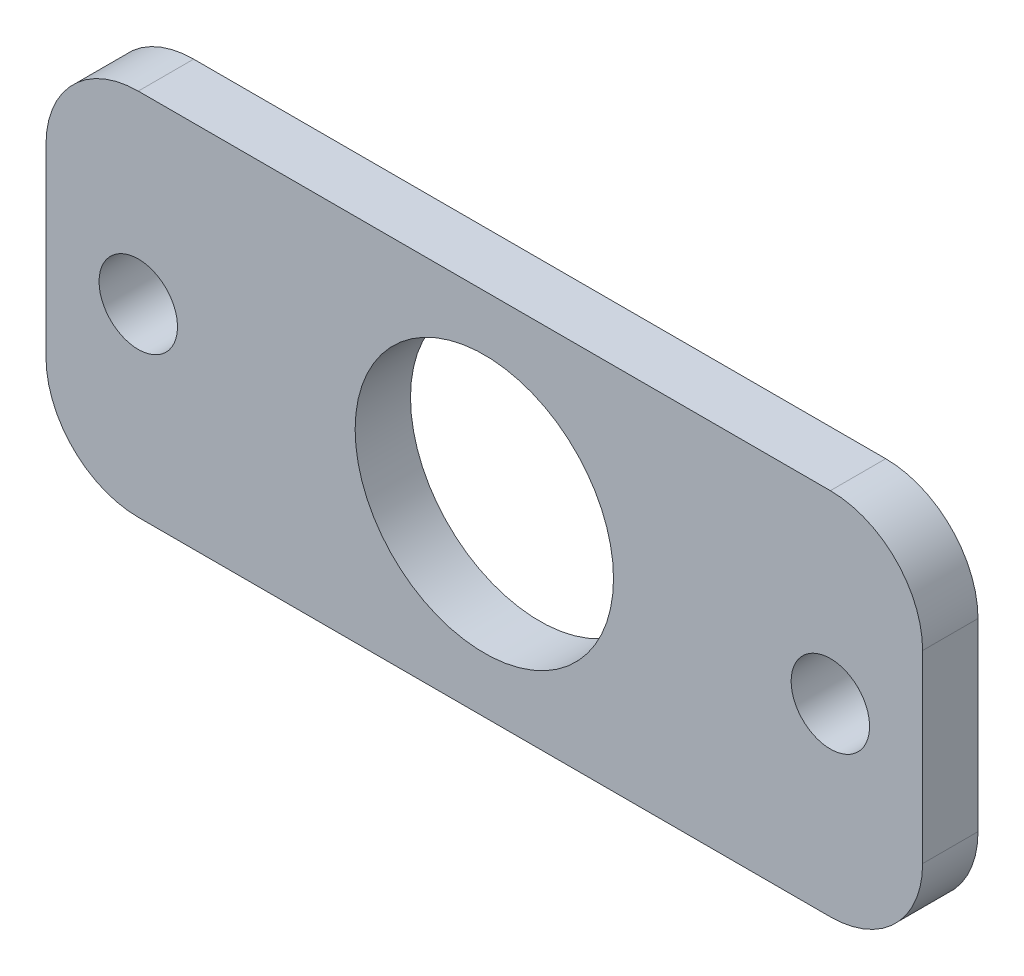
ISO-10303-21;
HEADER;
FILE_DESCRIPTION(('STEP AP214'),'2;1');
FILE_NAME('part.step','',(''),(''),'','','');
FILE_SCHEMA(('AUTOMOTIVE_DESIGN { 1 0 10303 214 1 1 1 1 }'));
ENDSEC;
DATA;
#1=APPLICATION_CONTEXT('core data for automotive mechanical design processes');
#2=APPLICATION_PROTOCOL_DEFINITION('international standard','automotive_design',2000,#1);
#3=PRODUCT_CONTEXT('',#1,'mechanical');
#4=PRODUCT('Part','Part','',(#3));
#5=PRODUCT_RELATED_PRODUCT_CATEGORY('part','',(#4));
#6=PRODUCT_DEFINITION_FORMATION('','',#4);
#7=PRODUCT_DEFINITION_CONTEXT('part definition',#1,'design');
#8=PRODUCT_DEFINITION('design','',#6,#7);
#9=PRODUCT_DEFINITION_SHAPE('','',#8);
#10=(LENGTH_UNIT() NAMED_UNIT(*) SI_UNIT(.MILLI.,.METRE.));
#11=(NAMED_UNIT(*) PLANE_ANGLE_UNIT() SI_UNIT($,.RADIAN.));
#12=(NAMED_UNIT(*) SI_UNIT($,.STERADIAN.) SOLID_ANGLE_UNIT());
#13=UNCERTAINTY_MEASURE_WITH_UNIT(LENGTH_MEASURE(1.E-05),#10,'distance_accuracy_value','');
#14=(GEOMETRIC_REPRESENTATION_CONTEXT(3) GLOBAL_UNCERTAINTY_ASSIGNED_CONTEXT((#13)) GLOBAL_UNIT_ASSIGNED_CONTEXT((#10,
#11,#12)) REPRESENTATION_CONTEXT('',''));
#15=CARTESIAN_POINT('',(0.,0.,0.));
#16=DIRECTION('',(0.,0.,1.));
#17=DIRECTION('',(1.,0.,0.));
#18=AXIS2_PLACEMENT_3D('',#15,#16,#17);
#19=CARTESIAN_POINT('',(0.,0.,0.));
#20=DIRECTION('',(0.,0.,-1.));
#21=DIRECTION('',(-1.,0.,0.));
#22=AXIS2_PLACEMENT_3D('',#19,#20,#21);
#23=PLANE('',#22);
#24=CARTESIAN_POINT('',(310.,-20.,0.));
#25=DIRECTION('',(0.,0.,-1.));
#26=DIRECTION('',(-1.,0.,0.));
#27=AXIS2_PLACEMENT_3D('',#24,#25,#26);
#28=CIRCLE('',#27,4.24999999999998);
#29=CARTESIAN_POINT('',(305.75,-20.,0.));
#30=VERTEX_POINT('',#29);
#31=EDGE_CURVE('E135',#30,#30,#28,.F.);
#32=ORIENTED_EDGE('',*,*,#31,.T.);
#33=EDGE_LOOP('',(#32));
#34=FACE_BOUND('',#33,.T.);
#35=CARTESIAN_POINT('',(347.5,-20.,0.));
#36=DIRECTION('',(0.,0.,-1.));
#37=DIRECTION('',(-1.,0.,0.));
#38=AXIS2_PLACEMENT_3D('',#35,#36,#37);
#39=CIRCLE('',#38,14.);
#40=CARTESIAN_POINT('',(333.5,-20.,0.));
#41=VERTEX_POINT('',#40);
#42=EDGE_CURVE('E106',#41,#41,#39,.F.);
#43=ORIENTED_EDGE('',*,*,#42,.T.);
#44=EDGE_LOOP('',(#43));
#45=FACE_BOUND('',#44,.T.);
#46=DIRECTION('',(0.,1.,0.));
#47=VECTOR('',#46,1.);
#48=CARTESIAN_POINT('',(300.,0.,0.));
#49=LINE('',#48,#47);
#50=CARTESIAN_POINT('',(300.,-30.,0.));
#51=VERTEX_POINT('',#50);
#52=CARTESIAN_POINT('',(300.,-10.,0.));
#53=VERTEX_POINT('',#52);
#54=EDGE_CURVE('E112',#51,#53,#49,.T.);
#55=ORIENTED_EDGE('',*,*,#54,.T.);
#56=CARTESIAN_POINT('',(310.,-10.,0.));
#57=DIRECTION('',(0.,0.,-1.));
#58=DIRECTION('',(-1.,0.,0.));
#59=AXIS2_PLACEMENT_3D('',#56,#57,#58);
#60=CIRCLE('',#59,10.);
#61=CARTESIAN_POINT('',(310.,0.,0.));
#62=VERTEX_POINT('',#61);
#63=EDGE_CURVE('E113',#62,#53,#60,.F.);
#64=ORIENTED_EDGE('',*,*,#63,.F.);
#65=DIRECTION('',(1.,0.,0.));
#66=VECTOR('',#65,1.);
#67=CARTESIAN_POINT('',(395.,0.,0.));
#68=LINE('',#67,#66);
#69=CARTESIAN_POINT('',(385.,0.,0.));
#70=VERTEX_POINT('',#69);
#71=EDGE_CURVE('E107',#62,#70,#68,.T.);
#72=ORIENTED_EDGE('',*,*,#71,.T.);
#73=CARTESIAN_POINT('',(385.,-10.,0.));
#74=DIRECTION('',(0.,0.,-1.));
#75=DIRECTION('',(-1.,0.,0.));
#76=AXIS2_PLACEMENT_3D('',#73,#74,#75);
#77=CIRCLE('',#76,10.);
#78=CARTESIAN_POINT('',(395.,-10.,0.));
#79=VERTEX_POINT('',#78);
#80=EDGE_CURVE('E110',#79,#70,#77,.F.);
#81=ORIENTED_EDGE('',*,*,#80,.F.);
#82=DIRECTION('',(0.,1.,0.));
#83=VECTOR('',#82,1.);
#84=CARTESIAN_POINT('',(395.,0.,0.));
#85=LINE('',#84,#83);
#86=CARTESIAN_POINT('',(395.,-30.,0.));
#87=VERTEX_POINT('',#86);
#88=EDGE_CURVE('E85',#79,#87,#85,.F.);
#89=ORIENTED_EDGE('',*,*,#88,.T.);
#90=CARTESIAN_POINT('',(385.,-30.,0.));
#91=DIRECTION('',(0.,0.,-1.));
#92=DIRECTION('',(-1.,0.,0.));
#93=AXIS2_PLACEMENT_3D('',#90,#91,#92);
#94=CIRCLE('',#93,10.);
#95=CARTESIAN_POINT('',(385.,-40.,0.));
#96=VERTEX_POINT('',#95);
#97=EDGE_CURVE('E19',#96,#87,#94,.F.);
#98=ORIENTED_EDGE('',*,*,#97,.F.);
#99=DIRECTION('',(-1.,0.,0.));
#100=VECTOR('',#99,1.);
#101=CARTESIAN_POINT('',(395.,-40.,0.));
#102=LINE('',#101,#100);
#103=CARTESIAN_POINT('',(310.,-40.,0.));
#104=VERTEX_POINT('',#103);
#105=EDGE_CURVE('E83',#96,#104,#102,.T.);
#106=ORIENTED_EDGE('',*,*,#105,.T.);
#107=CARTESIAN_POINT('',(310.,-30.,0.));
#108=DIRECTION('',(0.,0.,-1.));
#109=DIRECTION('',(-1.,0.,0.));
#110=AXIS2_PLACEMENT_3D('',#107,#108,#109);
#111=CIRCLE('',#110,10.);
#112=EDGE_CURVE('E96',#51,#104,#111,.F.);
#113=ORIENTED_EDGE('',*,*,#112,.F.);
#114=EDGE_LOOP('',(#55,#64,#72,#81,#89,#98,#106,#113));
#115=FACE_BOUND('',#114,.T.);
#116=CARTESIAN_POINT('',(385.,-20.,0.));
#117=DIRECTION('',(0.,0.,-1.));
#118=DIRECTION('',(-1.,0.,0.));
#119=AXIS2_PLACEMENT_3D('',#116,#117,#118);
#120=CIRCLE('',#119,4.24999999999998);
#121=CARTESIAN_POINT('',(380.75,-20.,0.));
#122=VERTEX_POINT('',#121);
#123=EDGE_CURVE('E138',#122,#122,#120,.F.);
#124=ORIENTED_EDGE('',*,*,#123,.T.);
#125=EDGE_LOOP('',(#124));
#126=FACE_BOUND('',#125,.T.);
#127=ADVANCED_FACE('F16',(#34,#45,#115,#126),#23,.T.);
#128=CARTESIAN_POINT('',(385.,-30.,6.00000000000001));
#129=DIRECTION('',(0.,0.,-1.));
#130=DIRECTION('',(-1.,0.,0.));
#131=AXIS2_PLACEMENT_3D('',#128,#129,#130);
#132=CYLINDRICAL_SURFACE('',#131,10.);
#133=ORIENTED_EDGE('',*,*,#97,.T.);
#134=DIRECTION('',(0.,0.,1.));
#135=VECTOR('',#134,1.);
#136=CARTESIAN_POINT('',(395.,-30.,6.00000000000001));
#137=LINE('',#136,#135);
#138=CARTESIAN_POINT('',(395.,-30.,6.00000000000001));
#139=VERTEX_POINT('',#138);
#140=EDGE_CURVE('E154',#87,#139,#137,.T.);
#141=ORIENTED_EDGE('',*,*,#140,.T.);
#142=CARTESIAN_POINT('',(385.,-30.,6.00000000000001));
#143=DIRECTION('',(0.,0.,-1.));
#144=DIRECTION('',(-1.,0.,0.));
#145=AXIS2_PLACEMENT_3D('',#142,#143,#144);
#146=CIRCLE('',#145,10.);
#147=CARTESIAN_POINT('',(385.,-40.,6.00000000000001));
#148=VERTEX_POINT('',#147);
#149=EDGE_CURVE('E100',#139,#148,#146,.T.);
#150=ORIENTED_EDGE('',*,*,#149,.T.);
#151=DIRECTION('',(0.,0.,1.));
#152=VECTOR('',#151,1.);
#153=CARTESIAN_POINT('',(385.,-40.,6.00000000000001));
#154=LINE('',#153,#152);
#155=EDGE_CURVE('E90',#148,#96,#154,.F.);
#156=ORIENTED_EDGE('',*,*,#155,.T.);
#157=EDGE_LOOP('',(#133,#141,#150,#156));
#158=FACE_BOUND('',#157,.T.);
#159=ADVANCED_FACE('F99',(#158),#132,.T.);
#160=CARTESIAN_POINT('',(395.,-40.,6.00000000000001));
#161=DIRECTION('',(0.,1.,0.));
#162=DIRECTION('',(-1.,0.,0.));
#163=AXIS2_PLACEMENT_3D('',#160,#161,#162);
#164=PLANE('',#163);
#165=ORIENTED_EDGE('',*,*,#155,.F.);
#166=DIRECTION('',(-1.,0.,0.));
#167=VECTOR('',#166,1.);
#168=CARTESIAN_POINT('',(0.,-40.,6.00000000000001));
#169=LINE('',#168,#167);
#170=CARTESIAN_POINT('',(310.,-40.,6.00000000000001));
#171=VERTEX_POINT('',#170);
#172=EDGE_CURVE('E133',#148,#171,#169,.T.);
#173=ORIENTED_EDGE('',*,*,#172,.T.);
#174=DIRECTION('',(0.,0.,-1.));
#175=VECTOR('',#174,1.);
#176=CARTESIAN_POINT('',(310.,-40.,6.00000000000001));
#177=LINE('',#176,#175);
#178=EDGE_CURVE('E95',#104,#171,#177,.F.);
#179=ORIENTED_EDGE('',*,*,#178,.F.);
#180=ORIENTED_EDGE('',*,*,#105,.F.);
#181=EDGE_LOOP('',(#165,#173,#179,#180));
#182=FACE_BOUND('',#181,.T.);
#183=ADVANCED_FACE('F92',(#182),#164,.F.);
#184=CARTESIAN_POINT('',(310.,-30.,6.00000000000001));
#185=DIRECTION('',(0.,0.,-1.));
#186=DIRECTION('',(-1.,0.,0.));
#187=AXIS2_PLACEMENT_3D('',#184,#185,#186);
#188=CYLINDRICAL_SURFACE('',#187,10.);
#189=ORIENTED_EDGE('',*,*,#112,.T.);
#190=ORIENTED_EDGE('',*,*,#178,.T.);
#191=CARTESIAN_POINT('',(310.,-30.,6.00000000000001));
#192=DIRECTION('',(0.,0.,-1.));
#193=DIRECTION('',(-1.,0.,0.));
#194=AXIS2_PLACEMENT_3D('',#191,#192,#193);
#195=CIRCLE('',#194,10.);
#196=CARTESIAN_POINT('',(300.,-30.,6.00000000000001));
#197=VERTEX_POINT('',#196);
#198=EDGE_CURVE('E130',#171,#197,#195,.T.);
#199=ORIENTED_EDGE('',*,*,#198,.T.);
#200=DIRECTION('',(0.,0.,-1.));
#201=VECTOR('',#200,1.);
#202=CARTESIAN_POINT('',(300.,-30.,6.00000000000001));
#203=LINE('',#202,#201);
#204=EDGE_CURVE('E114',#197,#51,#203,.T.);
#205=ORIENTED_EDGE('',*,*,#204,.T.);
#206=EDGE_LOOP('',(#189,#190,#199,#205));
#207=FACE_BOUND('',#206,.T.);
#208=ADVANCED_FACE('F181',(#207),#188,.T.);
#209=CARTESIAN_POINT('',(300.,0.,6.00000000000001));
#210=DIRECTION('',(1.,0.,0.));
#211=DIRECTION('',(0.,0.,-1.));
#212=AXIS2_PLACEMENT_3D('',#209,#210,#211);
#213=PLANE('',#212);
#214=ORIENTED_EDGE('',*,*,#204,.F.);
#215=DIRECTION('',(0.,1.,0.));
#216=VECTOR('',#215,1.);
#217=CARTESIAN_POINT('',(300.,0.,6.00000000000001));
#218=LINE('',#217,#216);
#219=CARTESIAN_POINT('',(300.,-10.,6.00000000000001));
#220=VERTEX_POINT('',#219);
#221=EDGE_CURVE('E129',#197,#220,#218,.T.);
#222=ORIENTED_EDGE('',*,*,#221,.T.);
#223=DIRECTION('',(0.,0.,-1.));
#224=VECTOR('',#223,1.);
#225=CARTESIAN_POINT('',(300.,-10.,6.00000000000001));
#226=LINE('',#225,#224);
#227=EDGE_CURVE('E145',#53,#220,#226,.F.);
#228=ORIENTED_EDGE('',*,*,#227,.F.);
#229=ORIENTED_EDGE('',*,*,#54,.F.);
#230=EDGE_LOOP('',(#214,#222,#228,#229));
#231=FACE_BOUND('',#230,.T.);
#232=ADVANCED_FACE('F180',(#231),#213,.F.);
#233=CARTESIAN_POINT('',(310.,-10.,6.00000000000001));
#234=DIRECTION('',(0.,0.,-1.));
#235=DIRECTION('',(-1.,0.,0.));
#236=AXIS2_PLACEMENT_3D('',#233,#234,#235);
#237=CYLINDRICAL_SURFACE('',#236,10.);
#238=ORIENTED_EDGE('',*,*,#63,.T.);
#239=ORIENTED_EDGE('',*,*,#227,.T.);
#240=CARTESIAN_POINT('',(310.,-10.,6.00000000000001));
#241=DIRECTION('',(0.,0.,-1.));
#242=DIRECTION('',(-1.,0.,0.));
#243=AXIS2_PLACEMENT_3D('',#240,#241,#242);
#244=CIRCLE('',#243,10.);
#245=CARTESIAN_POINT('',(310.,0.,6.00000000000001));
#246=VERTEX_POINT('',#245);
#247=EDGE_CURVE('E126',#220,#246,#244,.T.);
#248=ORIENTED_EDGE('',*,*,#247,.T.);
#249=DIRECTION('',(0.,0.,1.));
#250=VECTOR('',#249,1.);
#251=CARTESIAN_POINT('',(310.,0.,6.00000000000001));
#252=LINE('',#251,#250);
#253=EDGE_CURVE('E111',#246,#62,#252,.F.);
#254=ORIENTED_EDGE('',*,*,#253,.T.);
#255=EDGE_LOOP('',(#238,#239,#248,#254));
#256=FACE_BOUND('',#255,.T.);
#257=ADVANCED_FACE('F176',(#256),#237,.T.);
#258=CARTESIAN_POINT('',(395.,0.,6.00000000000001));
#259=DIRECTION('',(0.,-1.,0.));
#260=DIRECTION('',(1.,0.,0.));
#261=AXIS2_PLACEMENT_3D('',#258,#259,#260);
#262=PLANE('',#261);
#263=DIRECTION('',(0.,0.,-1.));
#264=VECTOR('',#263,1.);
#265=CARTESIAN_POINT('',(385.,0.,6.00000000000001));
#266=LINE('',#265,#264);
#267=CARTESIAN_POINT('',(385.,0.,6.00000000000001));
#268=VERTEX_POINT('',#267);
#269=EDGE_CURVE('E144',#70,#268,#266,.F.);
#270=ORIENTED_EDGE('',*,*,#269,.F.);
#271=ORIENTED_EDGE('',*,*,#71,.F.);
#272=ORIENTED_EDGE('',*,*,#253,.F.);
#273=DIRECTION('',(-1.,0.,0.));
#274=VECTOR('',#273,1.);
#275=CARTESIAN_POINT('',(0.,0.,6.00000000000001));
#276=LINE('',#275,#274);
#277=EDGE_CURVE('E125',#246,#268,#276,.F.);
#278=ORIENTED_EDGE('',*,*,#277,.T.);
#279=EDGE_LOOP('',(#270,#271,#272,#278));
#280=FACE_BOUND('',#279,.T.);
#281=ADVANCED_FACE('F172',(#280),#262,.F.);
#282=CARTESIAN_POINT('',(385.,-10.,6.00000000000001));
#283=DIRECTION('',(0.,0.,-1.));
#284=DIRECTION('',(-1.,0.,0.));
#285=AXIS2_PLACEMENT_3D('',#282,#283,#284);
#286=CYLINDRICAL_SURFACE('',#285,10.);
#287=ORIENTED_EDGE('',*,*,#80,.T.);
#288=ORIENTED_EDGE('',*,*,#269,.T.);
#289=CARTESIAN_POINT('',(385.,-10.,6.00000000000001));
#290=DIRECTION('',(0.,0.,-1.));
#291=DIRECTION('',(-1.,0.,0.));
#292=AXIS2_PLACEMENT_3D('',#289,#290,#291);
#293=CIRCLE('',#292,10.);
#294=CARTESIAN_POINT('',(395.,-10.,6.00000000000001));
#295=VERTEX_POINT('',#294);
#296=EDGE_CURVE('E122',#268,#295,#293,.T.);
#297=ORIENTED_EDGE('',*,*,#296,.T.);
#298=DIRECTION('',(0.,0.,1.));
#299=VECTOR('',#298,1.);
#300=CARTESIAN_POINT('',(395.,-10.,6.00000000000001));
#301=LINE('',#300,#299);
#302=EDGE_CURVE('E34',#295,#79,#301,.F.);
#303=ORIENTED_EDGE('',*,*,#302,.T.);
#304=EDGE_LOOP('',(#287,#288,#297,#303));
#305=FACE_BOUND('',#304,.T.);
#306=ADVANCED_FACE('F168',(#305),#286,.T.);
#307=CARTESIAN_POINT('',(395.,0.,6.00000000000001));
#308=DIRECTION('',(-1.,0.,0.));
#309=DIRECTION('',(0.,0.,1.));
#310=AXIS2_PLACEMENT_3D('',#307,#308,#309);
#311=PLANE('',#310);
#312=ORIENTED_EDGE('',*,*,#302,.F.);
#313=DIRECTION('',(0.,1.,0.));
#314=VECTOR('',#313,1.);
#315=CARTESIAN_POINT('',(395.,0.,6.00000000000001));
#316=LINE('',#315,#314);
#317=EDGE_CURVE('E121',#295,#139,#316,.F.);
#318=ORIENTED_EDGE('',*,*,#317,.T.);
#319=ORIENTED_EDGE('',*,*,#140,.F.);
#320=ORIENTED_EDGE('',*,*,#88,.F.);
#321=EDGE_LOOP('',(#312,#318,#319,#320));
#322=FACE_BOUND('',#321,.T.);
#323=ADVANCED_FACE('F162',(#322),#311,.F.);
#324=CARTESIAN_POINT('',(347.5,-20.,6.00000000000001));
#325=DIRECTION('',(0.,0.,-1.));
#326=DIRECTION('',(-1.,0.,0.));
#327=AXIS2_PLACEMENT_3D('',#324,#325,#326);
#328=CYLINDRICAL_SURFACE('',#327,14.);
#329=ORIENTED_EDGE('',*,*,#42,.F.);
#330=EDGE_LOOP('',(#329));
#331=FACE_BOUND('',#330,.T.);
#332=CARTESIAN_POINT('',(347.5,-20.,6.00000000000001));
#333=DIRECTION('',(0.,0.,-1.));
#334=DIRECTION('',(-1.,0.,0.));
#335=AXIS2_PLACEMENT_3D('',#332,#333,#334);
#336=CIRCLE('',#335,14.);
#337=CARTESIAN_POINT('',(333.5,-20.,6.00000000000001));
#338=VERTEX_POINT('',#337);
#339=EDGE_CURVE('E118',#338,#338,#336,.F.);
#340=ORIENTED_EDGE('',*,*,#339,.T.);
#341=EDGE_LOOP('',(#340));
#342=FACE_BOUND('',#341,.T.);
#343=ADVANCED_FACE('F206',(#331,#342),#328,.F.);
#344=CARTESIAN_POINT('',(385.,-20.,6.00000000000001));
#345=DIRECTION('',(0.,0.,-1.));
#346=DIRECTION('',(-1.,0.,0.));
#347=AXIS2_PLACEMENT_3D('',#344,#345,#346);
#348=CYLINDRICAL_SURFACE('',#347,4.24999999999998);
#349=ORIENTED_EDGE('',*,*,#123,.F.);
#350=EDGE_LOOP('',(#349));
#351=FACE_BOUND('',#350,.T.);
#352=CARTESIAN_POINT('',(385.,-20.,6.00000000000001));
#353=DIRECTION('',(0.,0.,-1.));
#354=DIRECTION('',(-1.,0.,0.));
#355=AXIS2_PLACEMENT_3D('',#352,#353,#354);
#356=CIRCLE('',#355,4.24999999999998);
#357=CARTESIAN_POINT('',(380.75,-20.,6.00000000000001));
#358=VERTEX_POINT('',#357);
#359=EDGE_CURVE('E25',#358,#358,#356,.F.);
#360=ORIENTED_EDGE('',*,*,#359,.T.);
#361=EDGE_LOOP('',(#360));
#362=FACE_BOUND('',#361,.T.);
#363=ADVANCED_FACE('F198',(#351,#362),#348,.F.);
#364=CARTESIAN_POINT('',(310.,-20.,6.00000000000001));
#365=DIRECTION('',(0.,0.,-1.));
#366=DIRECTION('',(-1.,0.,0.));
#367=AXIS2_PLACEMENT_3D('',#364,#365,#366);
#368=CYLINDRICAL_SURFACE('',#367,4.24999999999998);
#369=ORIENTED_EDGE('',*,*,#31,.F.);
#370=EDGE_LOOP('',(#369));
#371=FACE_BOUND('',#370,.T.);
#372=CARTESIAN_POINT('',(310.,-20.,6.00000000000001));
#373=DIRECTION('',(0.,0.,-1.));
#374=DIRECTION('',(-1.,0.,0.));
#375=AXIS2_PLACEMENT_3D('',#372,#373,#374);
#376=CIRCLE('',#375,4.24999999999998);
#377=CARTESIAN_POINT('',(305.75,-20.,6.00000000000001));
#378=VERTEX_POINT('',#377);
#379=EDGE_CURVE('E11',#378,#378,#376,.F.);
#380=ORIENTED_EDGE('',*,*,#379,.T.);
#381=EDGE_LOOP('',(#380));
#382=FACE_BOUND('',#381,.T.);
#383=ADVANCED_FACE('F192',(#371,#382),#368,.F.);
#384=CARTESIAN_POINT('',(0.,0.,6.00000000000001));
#385=DIRECTION('',(0.,0.,-1.));
#386=DIRECTION('',(-1.,0.,0.));
#387=AXIS2_PLACEMENT_3D('',#384,#385,#386);
#388=PLANE('',#387);
#389=ORIENTED_EDGE('',*,*,#379,.F.);
#390=EDGE_LOOP('',(#389));
#391=FACE_BOUND('',#390,.T.);
#392=ORIENTED_EDGE('',*,*,#359,.F.);
#393=EDGE_LOOP('',(#392));
#394=FACE_BOUND('',#393,.T.);
#395=ORIENTED_EDGE('',*,*,#339,.F.);
#396=EDGE_LOOP('',(#395));
#397=FACE_BOUND('',#396,.T.);
#398=ORIENTED_EDGE('',*,*,#296,.F.);
#399=ORIENTED_EDGE('',*,*,#277,.F.);
#400=ORIENTED_EDGE('',*,*,#247,.F.);
#401=ORIENTED_EDGE('',*,*,#221,.F.);
#402=ORIENTED_EDGE('',*,*,#198,.F.);
#403=ORIENTED_EDGE('',*,*,#172,.F.);
#404=ORIENTED_EDGE('',*,*,#149,.F.);
#405=ORIENTED_EDGE('',*,*,#317,.F.);
#406=EDGE_LOOP('',(#398,#399,#400,#401,#402,#403,#404,#405));
#407=FACE_BOUND('',#406,.T.);
#408=ADVANCED_FACE('F165',(#391,#394,#397,#407),#388,.F.);
#409=CLOSED_SHELL('',(#127,#159,#183,#208,#232,#257,#281,#306,#323,#343,#363,#383,#408));
#410=MANIFOLD_SOLID_BREP('B1',#409);
#411=ADVANCED_BREP_SHAPE_REPRESENTATION('',(#18,#410),#14);
#412=SHAPE_DEFINITION_REPRESENTATION(#9,#411);
ENDSEC;
END-ISO-10303-21;
